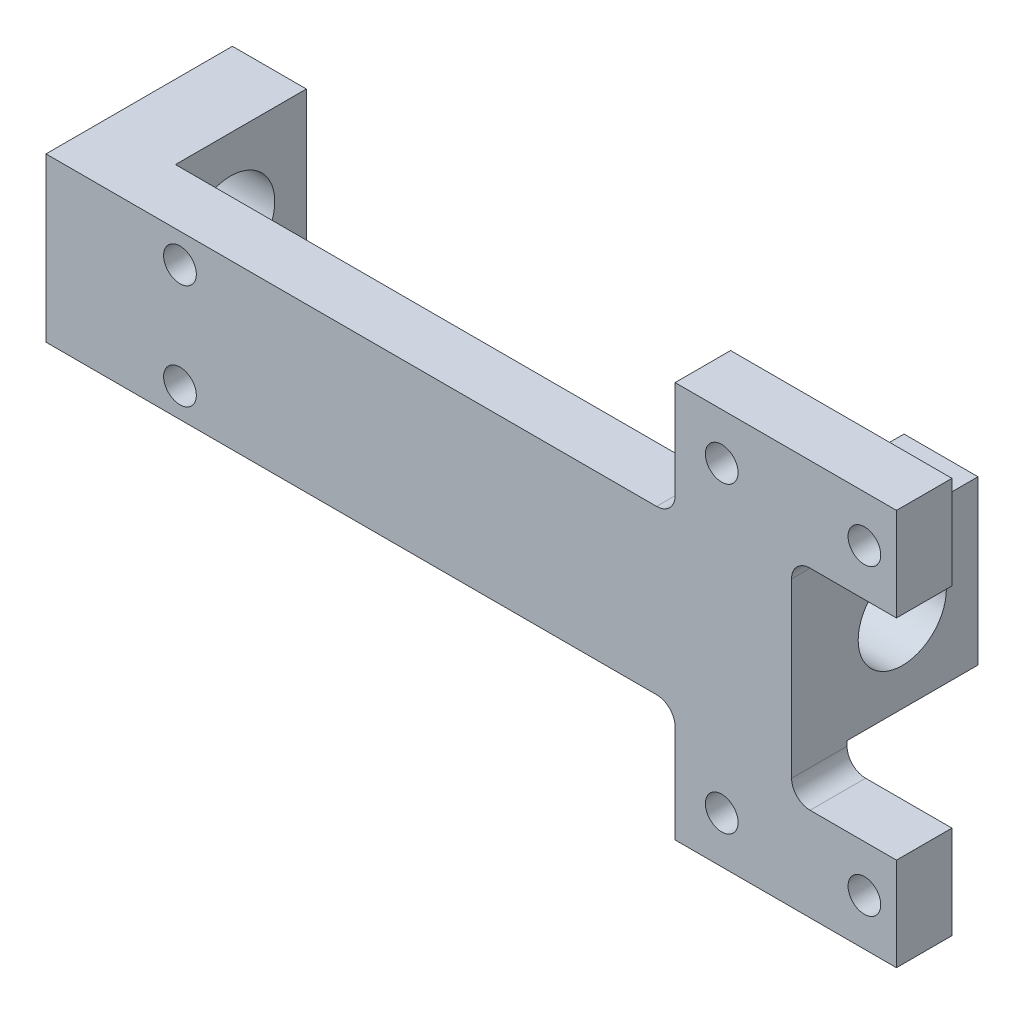
ISO-10303-21;
HEADER;
FILE_DESCRIPTION(('STEP AP214'),'2;1');
FILE_NAME('part.step','',(''),(''),'','','');
FILE_SCHEMA(('AUTOMOTIVE_DESIGN { 1 0 10303 214 1 1 1 1 }'));
ENDSEC;
DATA;
#1=APPLICATION_CONTEXT('core data for automotive mechanical design processes');
#2=APPLICATION_PROTOCOL_DEFINITION('international standard','automotive_design',2000,#1);
#3=PRODUCT_CONTEXT('',#1,'mechanical');
#4=PRODUCT('Part','Part','',(#3));
#5=PRODUCT_RELATED_PRODUCT_CATEGORY('part','',(#4));
#6=PRODUCT_DEFINITION_FORMATION('','',#4);
#7=PRODUCT_DEFINITION_CONTEXT('part definition',#1,'design');
#8=PRODUCT_DEFINITION('design','',#6,#7);
#9=PRODUCT_DEFINITION_SHAPE('','',#8);
#10=(LENGTH_UNIT() NAMED_UNIT(*) SI_UNIT(.MILLI.,.METRE.));
#11=(NAMED_UNIT(*) PLANE_ANGLE_UNIT() SI_UNIT($,.RADIAN.));
#12=(NAMED_UNIT(*) SI_UNIT($,.STERADIAN.) SOLID_ANGLE_UNIT());
#13=UNCERTAINTY_MEASURE_WITH_UNIT(LENGTH_MEASURE(1.E-05),#10,'distance_accuracy_value','');
#14=(GEOMETRIC_REPRESENTATION_CONTEXT(3) GLOBAL_UNCERTAINTY_ASSIGNED_CONTEXT((#13)) GLOBAL_UNIT_ASSIGNED_CONTEXT((#10,
#11,#12)) REPRESENTATION_CONTEXT('',''));
#15=CARTESIAN_POINT('',(0.,0.,0.));
#16=DIRECTION('',(0.,0.,1.));
#17=DIRECTION('',(1.,0.,0.));
#18=AXIS2_PLACEMENT_3D('',#15,#16,#17);
#19=CARTESIAN_POINT('',(64.,14.,-13.));
#20=DIRECTION('',(0.,-1.,0.));
#21=DIRECTION('',(0.,0.,-1.));
#22=AXIS2_PLACEMENT_3D('',#19,#20,#21);
#23=PLANE('',#22);
#24=DIRECTION('',(-1.,0.,0.));
#25=VECTOR('',#24,1.);
#26=CARTESIAN_POINT('',(64.,14.,19.));
#27=LINE('',#26,#25);
#28=CARTESIAN_POINT('',(40.825,14.,19.));
#29=VERTEX_POINT('',#28);
#30=CARTESIAN_POINT('',(-64.,14.,19.));
#31=VERTEX_POINT('',#30);
#32=EDGE_CURVE('E220',#29,#31,#27,.T.);
#33=ORIENTED_EDGE('',*,*,#32,.F.);
#34=DIRECTION('',(0.,0.,-1.));
#35=VECTOR('',#34,1.);
#36=CARTESIAN_POINT('',(40.825,14.,9.47500000000001));
#37=LINE('',#36,#35);
#38=CARTESIAN_POINT('',(40.825,14.,9.475));
#39=VERTEX_POINT('',#38);
#40=EDGE_CURVE('E227',#29,#39,#37,.T.);
#41=ORIENTED_EDGE('',*,*,#40,.T.);
#42=DIRECTION('',(1.,0.,0.));
#43=VECTOR('',#42,1.);
#44=CARTESIAN_POINT('',(-51.3,14.,9.475));
#45=LINE('',#44,#43);
#46=CARTESIAN_POINT('',(-51.3,14.,9.475));
#47=VERTEX_POINT('',#46);
#48=EDGE_CURVE('E252',#47,#39,#45,.T.);
#49=ORIENTED_EDGE('',*,*,#48,.F.);
#50=DIRECTION('',(0.,0.,-1.));
#51=VECTOR('',#50,1.);
#52=CARTESIAN_POINT('',(-51.3,14.,125.352056867745));
#53=LINE('',#52,#51);
#54=CARTESIAN_POINT('',(-51.3,14.,-13.));
#55=VERTEX_POINT('',#54);
#56=EDGE_CURVE('E305',#47,#55,#53,.T.);
#57=ORIENTED_EDGE('',*,*,#56,.T.);
#58=DIRECTION('',(-1.,0.,0.));
#59=VECTOR('',#58,1.);
#60=CARTESIAN_POINT('',(64.,14.,-13.));
#61=LINE('',#60,#59);
#62=CARTESIAN_POINT('',(-64.,14.,-13.));
#63=VERTEX_POINT('',#62);
#64=EDGE_CURVE('E788',#55,#63,#61,.T.);
#65=ORIENTED_EDGE('',*,*,#64,.T.);
#66=DIRECTION('',(0.,0.,1.));
#67=VECTOR('',#66,1.);
#68=CARTESIAN_POINT('',(-64.,14.,-13.));
#69=LINE('',#68,#67);
#70=EDGE_CURVE('E284',#63,#31,#69,.T.);
#71=ORIENTED_EDGE('',*,*,#70,.T.);
#72=EDGE_LOOP('',(#33,#41,#49,#57,#65,#71));
#73=FACE_BOUND('',#72,.T.);
#74=ADVANCED_FACE('F34',(#73),#23,.F.);
#75=CARTESIAN_POINT('',(64.,-14.,19.));
#76=DIRECTION('',(0.,1.,0.));
#77=DIRECTION('',(0.,0.,1.));
#78=AXIS2_PLACEMENT_3D('',#75,#76,#77);
#79=PLANE('',#78);
#80=DIRECTION('',(1.,0.,0.));
#81=VECTOR('',#80,1.);
#82=CARTESIAN_POINT('',(44.,-14.,9.475));
#83=LINE('',#82,#81);
#84=CARTESIAN_POINT('',(51.3,-14.,9.475));
#85=VERTEX_POINT('',#84);
#86=CARTESIAN_POINT('',(64.,-14.,9.475));
#87=VERTEX_POINT('',#86);
#88=EDGE_CURVE('E321',#85,#87,#83,.T.);
#89=ORIENTED_EDGE('',*,*,#88,.F.);
#90=DIRECTION('',(0.,0.,-1.));
#91=VECTOR('',#90,1.);
#92=CARTESIAN_POINT('',(51.3,-14.,125.352056867745));
#93=LINE('',#92,#91);
#94=CARTESIAN_POINT('',(51.3,-14.,-13.));
#95=VERTEX_POINT('',#94);
#96=EDGE_CURVE('E255',#85,#95,#93,.T.);
#97=ORIENTED_EDGE('',*,*,#96,.T.);
#98=DIRECTION('',(-1.,0.,0.));
#99=VECTOR('',#98,1.);
#100=CARTESIAN_POINT('',(64.,-14.,-13.));
#101=LINE('',#100,#99);
#102=CARTESIAN_POINT('',(64.,-14.,-13.));
#103=VERTEX_POINT('',#102);
#104=EDGE_CURVE('E325',#103,#95,#101,.T.);
#105=ORIENTED_EDGE('',*,*,#104,.F.);
#106=DIRECTION('',(0.,0.,-1.));
#107=VECTOR('',#106,1.);
#108=CARTESIAN_POINT('',(64.,-14.,19.));
#109=LINE('',#108,#107);
#110=EDGE_CURVE('E290',#87,#103,#109,.T.);
#111=ORIENTED_EDGE('',*,*,#110,.F.);
#112=EDGE_LOOP('',(#89,#97,#105,#111));
#113=FACE_BOUND('',#112,.T.);
#114=ADVANCED_FACE('F467',(#113),#79,.F.);
#115=DIRECTION('',(-1.,0.,0.));
#116=VECTOR('',#115,1.);
#117=CARTESIAN_POINT('',(-51.3,-14.,9.475));
#118=LINE('',#117,#116);
#119=CARTESIAN_POINT('',(40.825,-14.,9.475));
#120=VERTEX_POINT('',#119);
#121=CARTESIAN_POINT('',(-51.3,-14.,9.475));
#122=VERTEX_POINT('',#121);
#123=EDGE_CURVE('E295',#120,#122,#118,.T.);
#124=ORIENTED_EDGE('',*,*,#123,.F.);
#125=DIRECTION('',(0.,0.,-1.));
#126=VECTOR('',#125,1.);
#127=CARTESIAN_POINT('',(40.825,-14.,19.));
#128=LINE('',#127,#126);
#129=CARTESIAN_POINT('',(40.825,-14.,19.));
#130=VERTEX_POINT('',#129);
#131=EDGE_CURVE('E300',#120,#130,#128,.F.);
#132=ORIENTED_EDGE('',*,*,#131,.T.);
#133=DIRECTION('',(-1.,0.,0.));
#134=VECTOR('',#133,1.);
#135=CARTESIAN_POINT('',(64.,-14.,19.));
#136=LINE('',#135,#134);
#137=CARTESIAN_POINT('',(-64.,-14.,19.));
#138=VERTEX_POINT('',#137);
#139=EDGE_CURVE('E276',#130,#138,#136,.T.);
#140=ORIENTED_EDGE('',*,*,#139,.T.);
#141=DIRECTION('',(0.,0.,-1.));
#142=VECTOR('',#141,1.);
#143=CARTESIAN_POINT('',(-64.,-14.,19.));
#144=LINE('',#143,#142);
#145=CARTESIAN_POINT('',(-64.,-14.,-13.));
#146=VERTEX_POINT('',#145);
#147=EDGE_CURVE('E277',#138,#146,#144,.T.);
#148=ORIENTED_EDGE('',*,*,#147,.T.);
#149=CARTESIAN_POINT('',(-51.3,-14.,-13.));
#150=VERTEX_POINT('',#149);
#151=EDGE_CURVE('E470',#150,#146,#101,.T.);
#152=ORIENTED_EDGE('',*,*,#151,.F.);
#153=DIRECTION('',(0.,0.,-1.));
#154=VECTOR('',#153,1.);
#155=CARTESIAN_POINT('',(-51.3,-14.,125.352056867745));
#156=LINE('',#155,#154);
#157=EDGE_CURVE('E258',#122,#150,#156,.T.);
#158=ORIENTED_EDGE('',*,*,#157,.F.);
#159=EDGE_LOOP('',(#124,#132,#140,#148,#152,#158));
#160=FACE_BOUND('',#159,.T.);
#161=ADVANCED_FACE('F495',(#160),#79,.F.);
#162=CARTESIAN_POINT('',(64.,-14.,-13.));
#163=DIRECTION('',(0.,0.,1.));
#164=DIRECTION('',(1.,0.,0.));
#165=AXIS2_PLACEMENT_3D('',#162,#163,#164);
#166=PLANE('',#165);
#167=DIRECTION('',(0.,1.,0.));
#168=VECTOR('',#167,1.);
#169=CARTESIAN_POINT('',(-51.3,-14.,-13.));
#170=LINE('',#169,#168);
#171=EDGE_CURVE('E310',#150,#55,#170,.T.);
#172=ORIENTED_EDGE('',*,*,#171,.F.);
#173=ORIENTED_EDGE('',*,*,#151,.T.);
#174=DIRECTION('',(0.,1.,0.));
#175=VECTOR('',#174,1.);
#176=CARTESIAN_POINT('',(-64.,-14.,-13.));
#177=LINE('',#176,#175);
#178=EDGE_CURVE('E280',#146,#63,#177,.T.);
#179=ORIENTED_EDGE('',*,*,#178,.T.);
#180=ORIENTED_EDGE('',*,*,#64,.F.);
#181=EDGE_LOOP('',(#172,#173,#179,#180));
#182=FACE_BOUND('',#181,.T.);
#183=ADVANCED_FACE('F507',(#182),#166,.F.);
#184=DIRECTION('',(0.,-1.,0.));
#185=VECTOR('',#184,1.);
#186=CARTESIAN_POINT('',(51.3,-14.,-13.));
#187=LINE('',#186,#185);
#188=CARTESIAN_POINT('',(51.3,14.,-13.));
#189=VERTEX_POINT('',#188);
#190=EDGE_CURVE('E307',#189,#95,#187,.T.);
#191=ORIENTED_EDGE('',*,*,#190,.F.);
#192=CARTESIAN_POINT('',(64.,14.,-13.));
#193=VERTEX_POINT('',#192);
#194=EDGE_CURVE('E461',#193,#189,#61,.T.);
#195=ORIENTED_EDGE('',*,*,#194,.F.);
#196=DIRECTION('',(0.,1.,0.));
#197=VECTOR('',#196,1.);
#198=CARTESIAN_POINT('',(64.,-14.,-13.));
#199=LINE('',#198,#197);
#200=EDGE_CURVE('E267',#103,#193,#199,.T.);
#201=ORIENTED_EDGE('',*,*,#200,.F.);
#202=ORIENTED_EDGE('',*,*,#104,.T.);
#203=EDGE_LOOP('',(#191,#195,#201,#202));
#204=FACE_BOUND('',#203,.T.);
#205=ADVANCED_FACE('F469',(#204),#166,.F.);
#206=DIRECTION('',(0.,0.,-1.));
#207=VECTOR('',#206,1.);
#208=CARTESIAN_POINT('',(51.3,14.,125.352056867745));
#209=LINE('',#208,#207);
#210=CARTESIAN_POINT('',(51.3,14.,9.475));
#211=VERTEX_POINT('',#210);
#212=EDGE_CURVE('E299',#211,#189,#209,.T.);
#213=ORIENTED_EDGE('',*,*,#212,.F.);
#214=DIRECTION('',(1.,0.,0.));
#215=VECTOR('',#214,1.);
#216=CARTESIAN_POINT('',(44.,14.,9.475));
#217=LINE('',#216,#215);
#218=CARTESIAN_POINT('',(64.,14.,9.475));
#219=VERTEX_POINT('',#218);
#220=EDGE_CURVE('E324',#211,#219,#217,.T.);
#221=ORIENTED_EDGE('',*,*,#220,.T.);
#222=DIRECTION('',(0.,0.,1.));
#223=VECTOR('',#222,1.);
#224=CARTESIAN_POINT('',(64.,14.,-13.));
#225=LINE('',#224,#223);
#226=EDGE_CURVE('E262',#193,#219,#225,.T.);
#227=ORIENTED_EDGE('',*,*,#226,.F.);
#228=ORIENTED_EDGE('',*,*,#194,.T.);
#229=EDGE_LOOP('',(#213,#221,#227,#228));
#230=FACE_BOUND('',#229,.T.);
#231=ADVANCED_FACE('F460',(#230),#23,.F.);
#232=CARTESIAN_POINT('',(64.,0.,0.));
#233=DIRECTION('',(-1.,0.,0.));
#234=DIRECTION('',(0.,0.,1.));
#235=AXIS2_PLACEMENT_3D('',#232,#233,#234);
#236=CYLINDRICAL_SURFACE('',#235,7.5692);
#237=CARTESIAN_POINT('',(-64.,0.,0.));
#238=DIRECTION('',(1.,0.,0.));
#239=DIRECTION('',(0.,0.,-1.));
#240=AXIS2_PLACEMENT_3D('',#237,#238,#239);
#241=CIRCLE('',#240,7.5692);
#242=CARTESIAN_POINT('',(-64.,0.,-7.5692));
#243=VERTEX_POINT('',#242);
#244=EDGE_CURVE('E312',#243,#243,#241,.T.);
#245=ORIENTED_EDGE('',*,*,#244,.F.);
#246=EDGE_LOOP('',(#245));
#247=FACE_BOUND('',#246,.T.);
#248=CARTESIAN_POINT('',(-51.3,0.,0.));
#249=DIRECTION('',(1.,0.,0.));
#250=DIRECTION('',(0.,0.,-1.));
#251=AXIS2_PLACEMENT_3D('',#248,#249,#250);
#252=CIRCLE('',#251,7.5692);
#253=CARTESIAN_POINT('',(-51.3,0.,-7.5692));
#254=VERTEX_POINT('',#253);
#255=EDGE_CURVE('E309',#254,#254,#252,.T.);
#256=ORIENTED_EDGE('',*,*,#255,.T.);
#257=EDGE_LOOP('',(#256));
#258=FACE_BOUND('',#257,.T.);
#259=ADVANCED_FACE('F501',(#247,#258),#236,.F.);
#260=CARTESIAN_POINT('',(64.,0.,0.));
#261=DIRECTION('',(1.,0.,0.));
#262=DIRECTION('',(0.,0.,-1.));
#263=AXIS2_PLACEMENT_3D('',#260,#261,#262);
#264=CIRCLE('',#263,7.5692);
#265=CARTESIAN_POINT('',(64.,0.,-7.5692));
#266=VERTEX_POINT('',#265);
#267=EDGE_CURVE('E281',#266,#266,#264,.T.);
#268=ORIENTED_EDGE('',*,*,#267,.T.);
#269=EDGE_LOOP('',(#268));
#270=FACE_BOUND('',#269,.T.);
#271=CARTESIAN_POINT('',(51.3,0.,0.));
#272=DIRECTION('',(-1.,0.,0.));
#273=DIRECTION('',(0.,0.,1.));
#274=AXIS2_PLACEMENT_3D('',#271,#272,#273);
#275=CIRCLE('',#274,7.5692);
#276=CARTESIAN_POINT('',(51.3,0.,7.5692));
#277=VERTEX_POINT('',#276);
#278=EDGE_CURVE('E251',#277,#277,#275,.T.);
#279=ORIENTED_EDGE('',*,*,#278,.T.);
#280=EDGE_LOOP('',(#279));
#281=FACE_BOUND('',#280,.T.);
#282=ADVANCED_FACE('F475',(#270,#281),#236,.F.);
#283=CARTESIAN_POINT('',(64.,0.,0.));
#284=DIRECTION('',(1.,0.,0.));
#285=DIRECTION('',(0.,0.,-1.));
#286=AXIS2_PLACEMENT_3D('',#283,#284,#285);
#287=PLANE('',#286);
#288=DIRECTION('',(0.,1.,0.));
#289=VECTOR('',#288,1.);
#290=CARTESIAN_POINT('',(64.,14.,9.475));
#291=LINE('',#290,#289);
#292=CARTESIAN_POINT('',(64.,14.825,9.475));
#293=VERTEX_POINT('',#292);
#294=EDGE_CURVE('E194',#219,#293,#291,.T.);
#295=ORIENTED_EDGE('',*,*,#294,.T.);
#296=DIRECTION('',(0.,0.,-1.));
#297=VECTOR('',#296,1.);
#298=CARTESIAN_POINT('',(64.,14.825,0.));
#299=LINE('',#298,#297);
#300=CARTESIAN_POINT('',(64.,14.825,19.));
#301=VERTEX_POINT('',#300);
#302=EDGE_CURVE('E424',#293,#301,#299,.F.);
#303=ORIENTED_EDGE('',*,*,#302,.T.);
#304=DIRECTION('',(0.,-1.,0.));
#305=VECTOR('',#304,1.);
#306=CARTESIAN_POINT('',(64.,14.,19.));
#307=LINE('',#306,#305);
#308=CARTESIAN_POINT('',(64.,-14.825,19.));
#309=VERTEX_POINT('',#308);
#310=EDGE_CURVE('E266',#301,#309,#307,.T.);
#311=ORIENTED_EDGE('',*,*,#310,.T.);
#312=DIRECTION('',(0.,0.,-1.));
#313=VECTOR('',#312,1.);
#314=CARTESIAN_POINT('',(64.,-14.825,9.475));
#315=LINE('',#314,#313);
#316=CARTESIAN_POINT('',(64.,-14.825,9.475));
#317=VERTEX_POINT('',#316);
#318=EDGE_CURVE('E421',#309,#317,#315,.T.);
#319=ORIENTED_EDGE('',*,*,#318,.T.);
#320=DIRECTION('',(0.,-1.,0.));
#321=VECTOR('',#320,1.);
#322=CARTESIAN_POINT('',(64.,-14.,9.475));
#323=LINE('',#322,#321);
#324=EDGE_CURVE('E242',#87,#317,#323,.T.);
#325=ORIENTED_EDGE('',*,*,#324,.F.);
#326=ORIENTED_EDGE('',*,*,#110,.T.);
#327=ORIENTED_EDGE('',*,*,#200,.T.);
#328=ORIENTED_EDGE('',*,*,#226,.T.);
#329=EDGE_LOOP('',(#295,#303,#311,#319,#325,#326,#327,#328));
#330=FACE_BOUND('',#329,.T.);
#331=ORIENTED_EDGE('',*,*,#267,.F.);
#332=EDGE_LOOP('',(#331));
#333=FACE_BOUND('',#332,.T.);
#334=ADVANCED_FACE('F453',(#330,#333),#287,.T.);
#335=CARTESIAN_POINT('',(-64.,0.,0.));
#336=DIRECTION('',(1.,0.,0.));
#337=DIRECTION('',(0.,0.,-1.));
#338=AXIS2_PLACEMENT_3D('',#335,#336,#337);
#339=PLANE('',#338);
#340=ORIENTED_EDGE('',*,*,#147,.F.);
#341=DIRECTION('',(0.,-1.,0.));
#342=VECTOR('',#341,1.);
#343=CARTESIAN_POINT('',(-64.,14.,19.));
#344=LINE('',#343,#342);
#345=EDGE_CURVE('E287',#31,#138,#344,.T.);
#346=ORIENTED_EDGE('',*,*,#345,.F.);
#347=ORIENTED_EDGE('',*,*,#70,.F.);
#348=ORIENTED_EDGE('',*,*,#178,.F.);
#349=EDGE_LOOP('',(#340,#346,#347,#348));
#350=FACE_BOUND('',#349,.T.);
#351=ORIENTED_EDGE('',*,*,#244,.T.);
#352=EDGE_LOOP('',(#351));
#353=FACE_BOUND('',#352,.T.);
#354=ADVANCED_FACE('F612',(#350,#353),#339,.F.);
#355=CARTESIAN_POINT('',(64.,14.,19.));
#356=DIRECTION('',(0.,0.,-1.));
#357=DIRECTION('',(-1.,0.,0.));
#358=AXIS2_PLACEMENT_3D('',#355,#356,#357);
#359=PLANE('',#358);
#360=CARTESIAN_POINT('',(76.5,26.,19.));
#361=DIRECTION('',(0.,0.,-1.));
#362=DIRECTION('',(-1.,0.,0.));
#363=AXIS2_PLACEMENT_3D('',#360,#361,#362);
#364=CIRCLE('',#363,2.8067);
#365=CARTESIAN_POINT('',(73.6933,26.,19.));
#366=VERTEX_POINT('',#365);
#367=EDGE_CURVE('E801',#366,#366,#364,.T.);
#368=ORIENTED_EDGE('',*,*,#367,.T.);
#369=EDGE_LOOP('',(#368));
#370=FACE_BOUND('',#369,.T.);
#371=CARTESIAN_POINT('',(52.,26.,19.));
#372=DIRECTION('',(0.,0.,-1.));
#373=DIRECTION('',(-1.,0.,0.));
#374=AXIS2_PLACEMENT_3D('',#371,#372,#373);
#375=CIRCLE('',#374,2.8067);
#376=CARTESIAN_POINT('',(49.1933,26.,19.));
#377=VERTEX_POINT('',#376);
#378=EDGE_CURVE('E207',#377,#377,#375,.T.);
#379=ORIENTED_EDGE('',*,*,#378,.T.);
#380=EDGE_LOOP('',(#379));
#381=FACE_BOUND('',#380,.T.);
#382=CARTESIAN_POINT('',(76.5,-26.,19.));
#383=DIRECTION('',(0.,0.,-1.));
#384=DIRECTION('',(-1.,0.,0.));
#385=AXIS2_PLACEMENT_3D('',#382,#383,#384);
#386=CIRCLE('',#385,2.8067);
#387=CARTESIAN_POINT('',(73.6933,-26.,19.));
#388=VERTEX_POINT('',#387);
#389=EDGE_CURVE('E389',#388,#388,#386,.T.);
#390=ORIENTED_EDGE('',*,*,#389,.T.);
#391=EDGE_LOOP('',(#390));
#392=FACE_BOUND('',#391,.T.);
#393=CARTESIAN_POINT('',(52.,-26.,19.));
#394=DIRECTION('',(0.,0.,-1.));
#395=DIRECTION('',(-1.,0.,0.));
#396=AXIS2_PLACEMENT_3D('',#393,#394,#395);
#397=CIRCLE('',#396,2.8067);
#398=CARTESIAN_POINT('',(49.1933,-26.,19.));
#399=VERTEX_POINT('',#398);
#400=EDGE_CURVE('E395',#399,#399,#397,.T.);
#401=ORIENTED_EDGE('',*,*,#400,.T.);
#402=EDGE_LOOP('',(#401));
#403=FACE_BOUND('',#402,.T.);
#404=CARTESIAN_POINT('',(-41.,-8.99999999999999,19.));
#405=DIRECTION('',(0.,0.,-1.));
#406=DIRECTION('',(-1.,0.,0.));
#407=AXIS2_PLACEMENT_3D('',#404,#405,#406);
#408=CIRCLE('',#407,2.8067);
#409=CARTESIAN_POINT('',(-43.8067,-8.99999999999999,19.));
#410=VERTEX_POINT('',#409);
#411=EDGE_CURVE('E347',#410,#410,#408,.T.);
#412=ORIENTED_EDGE('',*,*,#411,.T.);
#413=EDGE_LOOP('',(#412));
#414=FACE_BOUND('',#413,.T.);
#415=CARTESIAN_POINT('',(-41.,9.00000000000001,19.));
#416=DIRECTION('',(0.,0.,-1.));
#417=DIRECTION('',(-1.,0.,0.));
#418=AXIS2_PLACEMENT_3D('',#415,#416,#417);
#419=CIRCLE('',#418,2.8067);
#420=CARTESIAN_POINT('',(-43.8067,9.00000000000001,19.));
#421=VERTEX_POINT('',#420);
#422=EDGE_CURVE('E259',#421,#421,#419,.T.);
#423=ORIENTED_EDGE('',*,*,#422,.T.);
#424=EDGE_LOOP('',(#423));
#425=FACE_BOUND('',#424,.T.);
#426=ORIENTED_EDGE('',*,*,#345,.T.);
#427=ORIENTED_EDGE('',*,*,#139,.F.);
#428=CARTESIAN_POINT('',(40.825,-17.175,19.));
#429=DIRECTION('',(0.,0.,-1.));
#430=DIRECTION('',(-1.,0.,0.));
#431=AXIS2_PLACEMENT_3D('',#428,#429,#430);
#432=CIRCLE('',#431,3.175);
#433=CARTESIAN_POINT('',(44.,-17.175,19.));
#434=VERTEX_POINT('',#433);
#435=EDGE_CURVE('E436',#130,#434,#432,.T.);
#436=ORIENTED_EDGE('',*,*,#435,.T.);
#437=DIRECTION('',(0.,-1.,0.));
#438=VECTOR('',#437,1.);
#439=CARTESIAN_POINT('',(44.,-14.,19.));
#440=LINE('',#439,#438);
#441=CARTESIAN_POINT('',(44.,-34.,19.));
#442=VERTEX_POINT('',#441);
#443=EDGE_CURVE('E231',#434,#442,#440,.T.);
#444=ORIENTED_EDGE('',*,*,#443,.T.);
#445=DIRECTION('',(1.,0.,0.));
#446=VECTOR('',#445,1.);
#447=CARTESIAN_POINT('',(44.,-34.,19.));
#448=LINE('',#447,#446);
#449=CARTESIAN_POINT('',(82.,-34.,19.));
#450=VERTEX_POINT('',#449);
#451=EDGE_CURVE('E235',#442,#450,#448,.T.);
#452=ORIENTED_EDGE('',*,*,#451,.T.);
#453=DIRECTION('',(0.,1.,0.));
#454=VECTOR('',#453,1.);
#455=CARTESIAN_POINT('',(82.,-18.,19.));
#456=LINE('',#455,#454);
#457=CARTESIAN_POINT('',(82.,-18.,19.));
#458=VERTEX_POINT('',#457);
#459=EDGE_CURVE('E398',#450,#458,#456,.T.);
#460=ORIENTED_EDGE('',*,*,#459,.T.);
#461=DIRECTION('',(-1.,0.,0.));
#462=VECTOR('',#461,1.);
#463=CARTESIAN_POINT('',(64.,-18.,19.));
#464=LINE('',#463,#462);
#465=CARTESIAN_POINT('',(67.175,-18.,19.));
#466=VERTEX_POINT('',#465);
#467=EDGE_CURVE('E340',#458,#466,#464,.T.);
#468=ORIENTED_EDGE('',*,*,#467,.T.);
#469=CARTESIAN_POINT('',(67.175,-14.825,19.));
#470=DIRECTION('',(0.,0.,-1.));
#471=DIRECTION('',(-1.,0.,0.));
#472=AXIS2_PLACEMENT_3D('',#469,#470,#471);
#473=CIRCLE('',#472,3.175);
#474=EDGE_CURVE('E12',#466,#309,#473,.T.);
#475=ORIENTED_EDGE('',*,*,#474,.T.);
#476=ORIENTED_EDGE('',*,*,#310,.F.);
#477=CARTESIAN_POINT('',(67.175,14.825,19.));
#478=DIRECTION('',(0.,0.,-1.));
#479=DIRECTION('',(-1.,0.,0.));
#480=AXIS2_PLACEMENT_3D('',#477,#478,#479);
#481=CIRCLE('',#480,3.175);
#482=CARTESIAN_POINT('',(67.175,18.,19.));
#483=VERTEX_POINT('',#482);
#484=EDGE_CURVE('E440',#301,#483,#481,.T.);
#485=ORIENTED_EDGE('',*,*,#484,.T.);
#486=DIRECTION('',(-1.,0.,0.));
#487=VECTOR('',#486,1.);
#488=CARTESIAN_POINT('',(64.,18.,19.));
#489=LINE('',#488,#487);
#490=CARTESIAN_POINT('',(82.,18.,19.));
#491=VERTEX_POINT('',#490);
#492=EDGE_CURVE('E226',#491,#483,#489,.T.);
#493=ORIENTED_EDGE('',*,*,#492,.F.);
#494=DIRECTION('',(0.,-1.,0.));
#495=VECTOR('',#494,1.);
#496=CARTESIAN_POINT('',(82.,18.,19.));
#497=LINE('',#496,#495);
#498=CARTESIAN_POINT('',(82.,34.,19.));
#499=VERTEX_POINT('',#498);
#500=EDGE_CURVE('E386',#499,#491,#497,.T.);
#501=ORIENTED_EDGE('',*,*,#500,.F.);
#502=DIRECTION('',(1.,0.,0.));
#503=VECTOR('',#502,1.);
#504=CARTESIAN_POINT('',(44.,34.,19.));
#505=LINE('',#504,#503);
#506=CARTESIAN_POINT('',(44.,34.,19.));
#507=VERTEX_POINT('',#506);
#508=EDGE_CURVE('E383',#507,#499,#505,.T.);
#509=ORIENTED_EDGE('',*,*,#508,.F.);
#510=DIRECTION('',(0.,1.,0.));
#511=VECTOR('',#510,1.);
#512=CARTESIAN_POINT('',(44.,14.,19.));
#513=LINE('',#512,#511);
#514=CARTESIAN_POINT('',(44.,17.175,19.));
#515=VERTEX_POINT('',#514);
#516=EDGE_CURVE('E189',#515,#507,#513,.T.);
#517=ORIENTED_EDGE('',*,*,#516,.F.);
#518=CARTESIAN_POINT('',(40.825,17.175,19.));
#519=DIRECTION('',(0.,0.,-1.));
#520=DIRECTION('',(-1.,0.,0.));
#521=AXIS2_PLACEMENT_3D('',#518,#519,#520);
#522=CIRCLE('',#521,3.175);
#523=EDGE_CURVE('E432',#515,#29,#522,.T.);
#524=ORIENTED_EDGE('',*,*,#523,.T.);
#525=ORIENTED_EDGE('',*,*,#32,.T.);
#526=EDGE_LOOP('',(#426,#427,#436,#444,#452,#460,#468,#475,#476,#485,#493,#501,#509,#517,#524,#525));
#527=FACE_BOUND('',#526,.T.);
#528=ADVANCED_FACE('F402',(#370,#381,#392,#403,#414,#425,#527),#359,.F.);
#529=CARTESIAN_POINT('',(-51.3,-14.,125.352056867745));
#530=DIRECTION('',(1.,0.,0.));
#531=DIRECTION('',(0.,0.,-1.));
#532=AXIS2_PLACEMENT_3D('',#529,#530,#531);
#533=PLANE('',#532);
#534=ORIENTED_EDGE('',*,*,#255,.F.);
#535=EDGE_LOOP('',(#534));
#536=FACE_BOUND('',#535,.T.);
#537=ORIENTED_EDGE('',*,*,#171,.T.);
#538=ORIENTED_EDGE('',*,*,#56,.F.);
#539=DIRECTION('',(0.,1.,0.));
#540=VECTOR('',#539,1.);
#541=CARTESIAN_POINT('',(-51.3,-14.,9.475));
#542=LINE('',#541,#540);
#543=EDGE_CURVE('E298',#122,#47,#542,.T.);
#544=ORIENTED_EDGE('',*,*,#543,.F.);
#545=ORIENTED_EDGE('',*,*,#157,.T.);
#546=EDGE_LOOP('',(#537,#538,#544,#545));
#547=FACE_BOUND('',#546,.T.);
#548=ADVANCED_FACE('F478',(#536,#547),#533,.T.);
#549=CARTESIAN_POINT('',(51.3,-14.,125.352056867745));
#550=DIRECTION('',(-1.,0.,0.));
#551=DIRECTION('',(0.,0.,1.));
#552=AXIS2_PLACEMENT_3D('',#549,#550,#551);
#553=PLANE('',#552);
#554=ORIENTED_EDGE('',*,*,#278,.F.);
#555=EDGE_LOOP('',(#554));
#556=FACE_BOUND('',#555,.T.);
#557=ORIENTED_EDGE('',*,*,#190,.T.);
#558=ORIENTED_EDGE('',*,*,#96,.F.);
#559=DIRECTION('',(0.,-1.,0.));
#560=VECTOR('',#559,1.);
#561=CARTESIAN_POINT('',(51.3,-14.,9.475));
#562=LINE('',#561,#560);
#563=EDGE_CURVE('E248',#211,#85,#562,.T.);
#564=ORIENTED_EDGE('',*,*,#563,.F.);
#565=ORIENTED_EDGE('',*,*,#212,.T.);
#566=EDGE_LOOP('',(#557,#558,#564,#565));
#567=FACE_BOUND('',#566,.T.);
#568=ADVANCED_FACE('F463',(#556,#567),#553,.T.);
#569=CARTESIAN_POINT('',(64.,14.,9.475));
#570=DIRECTION('',(0.,0.,-1.));
#571=DIRECTION('',(-1.,0.,0.));
#572=AXIS2_PLACEMENT_3D('',#569,#570,#571);
#573=PLANE('',#572);
#574=CARTESIAN_POINT('',(76.5,26.,9.475));
#575=DIRECTION('',(0.,0.,-1.));
#576=DIRECTION('',(-1.,0.,0.));
#577=AXIS2_PLACEMENT_3D('',#574,#575,#576);
#578=CIRCLE('',#577,2.8067);
#579=CARTESIAN_POINT('',(73.6933,26.,9.475));
#580=VERTEX_POINT('',#579);
#581=EDGE_CURVE('E804',#580,#580,#578,.T.);
#582=ORIENTED_EDGE('',*,*,#581,.F.);
#583=EDGE_LOOP('',(#582));
#584=FACE_BOUND('',#583,.T.);
#585=CARTESIAN_POINT('',(52.,26.,9.475));
#586=DIRECTION('',(0.,0.,-1.));
#587=DIRECTION('',(-1.,0.,0.));
#588=AXIS2_PLACEMENT_3D('',#585,#586,#587);
#589=CIRCLE('',#588,2.8067);
#590=CARTESIAN_POINT('',(49.1933,26.,9.475));
#591=VERTEX_POINT('',#590);
#592=EDGE_CURVE('E210',#591,#591,#589,.T.);
#593=ORIENTED_EDGE('',*,*,#592,.F.);
#594=EDGE_LOOP('',(#593));
#595=FACE_BOUND('',#594,.T.);
#596=CARTESIAN_POINT('',(76.5,-26.,9.475));
#597=DIRECTION('',(0.,0.,-1.));
#598=DIRECTION('',(-1.,0.,0.));
#599=AXIS2_PLACEMENT_3D('',#596,#597,#598);
#600=CIRCLE('',#599,2.8067);
#601=CARTESIAN_POINT('',(73.6933,-26.,9.475));
#602=VERTEX_POINT('',#601);
#603=EDGE_CURVE('E225',#602,#602,#600,.T.);
#604=ORIENTED_EDGE('',*,*,#603,.F.);
#605=EDGE_LOOP('',(#604));
#606=FACE_BOUND('',#605,.T.);
#607=CARTESIAN_POINT('',(52.,-26.,9.475));
#608=DIRECTION('',(0.,0.,-1.));
#609=DIRECTION('',(-1.,0.,0.));
#610=AXIS2_PLACEMENT_3D('',#607,#608,#609);
#611=CIRCLE('',#610,2.8067);
#612=CARTESIAN_POINT('',(49.1933,-26.,9.475));
#613=VERTEX_POINT('',#612);
#614=EDGE_CURVE('E392',#613,#613,#611,.T.);
#615=ORIENTED_EDGE('',*,*,#614,.F.);
#616=EDGE_LOOP('',(#615));
#617=FACE_BOUND('',#616,.T.);
#618=CARTESIAN_POINT('',(-41.,-8.99999999999999,9.475));
#619=DIRECTION('',(0.,0.,-1.));
#620=DIRECTION('',(-1.,0.,0.));
#621=AXIS2_PLACEMENT_3D('',#618,#619,#620);
#622=CIRCLE('',#621,2.8067);
#623=CARTESIAN_POINT('',(-43.8067,-8.99999999999999,9.475));
#624=VERTEX_POINT('',#623);
#625=EDGE_CURVE('E234',#624,#624,#622,.T.);
#626=ORIENTED_EDGE('',*,*,#625,.F.);
#627=EDGE_LOOP('',(#626));
#628=FACE_BOUND('',#627,.T.);
#629=CARTESIAN_POINT('',(-41.,9.00000000000001,9.475));
#630=DIRECTION('',(0.,0.,-1.));
#631=DIRECTION('',(-1.,0.,0.));
#632=AXIS2_PLACEMENT_3D('',#629,#630,#631);
#633=CIRCLE('',#632,2.8067);
#634=CARTESIAN_POINT('',(-43.8067,9.00000000000001,9.475));
#635=VERTEX_POINT('',#634);
#636=EDGE_CURVE('E350',#635,#635,#633,.T.);
#637=ORIENTED_EDGE('',*,*,#636,.F.);
#638=EDGE_LOOP('',(#637));
#639=FACE_BOUND('',#638,.T.);
#640=ORIENTED_EDGE('',*,*,#48,.T.);
#641=CARTESIAN_POINT('',(40.825,17.175,9.475));
#642=DIRECTION('',(0.,0.,-1.));
#643=DIRECTION('',(-1.,0.,0.));
#644=AXIS2_PLACEMENT_3D('',#641,#642,#643);
#645=CIRCLE('',#644,3.175);
#646=CARTESIAN_POINT('',(44.,17.175,9.475));
#647=VERTEX_POINT('',#646);
#648=EDGE_CURVE('E206',#39,#647,#645,.F.);
#649=ORIENTED_EDGE('',*,*,#648,.T.);
#650=DIRECTION('',(0.,-1.,0.));
#651=VECTOR('',#650,1.);
#652=CARTESIAN_POINT('',(44.,14.,9.475));
#653=LINE('',#652,#651);
#654=CARTESIAN_POINT('',(44.,34.,9.475));
#655=VERTEX_POINT('',#654);
#656=EDGE_CURVE('E186',#655,#647,#653,.T.);
#657=ORIENTED_EDGE('',*,*,#656,.F.);
#658=DIRECTION('',(-1.,0.,0.));
#659=VECTOR('',#658,1.);
#660=CARTESIAN_POINT('',(44.,34.,9.475));
#661=LINE('',#660,#659);
#662=CARTESIAN_POINT('',(82.,34.,9.475));
#663=VERTEX_POINT('',#662);
#664=EDGE_CURVE('E197',#663,#655,#661,.T.);
#665=ORIENTED_EDGE('',*,*,#664,.F.);
#666=DIRECTION('',(0.,1.,0.));
#667=VECTOR('',#666,1.);
#668=CARTESIAN_POINT('',(82.,18.,9.475));
#669=LINE('',#668,#667);
#670=CARTESIAN_POINT('',(82.,18.,9.475));
#671=VERTEX_POINT('',#670);
#672=EDGE_CURVE('E202',#671,#663,#669,.T.);
#673=ORIENTED_EDGE('',*,*,#672,.F.);
#674=DIRECTION('',(1.,0.,0.));
#675=VECTOR('',#674,1.);
#676=CARTESIAN_POINT('',(64.,18.,9.475));
#677=LINE('',#676,#675);
#678=CARTESIAN_POINT('',(67.175,18.,9.475));
#679=VERTEX_POINT('',#678);
#680=EDGE_CURVE('E373',#679,#671,#677,.T.);
#681=ORIENTED_EDGE('',*,*,#680,.F.);
#682=CARTESIAN_POINT('',(67.175,14.825,9.475));
#683=DIRECTION('',(0.,0.,-1.));
#684=DIRECTION('',(-1.,0.,0.));
#685=AXIS2_PLACEMENT_3D('',#682,#683,#684);
#686=CIRCLE('',#685,3.175);
#687=EDGE_CURVE('E438',#679,#293,#686,.F.);
#688=ORIENTED_EDGE('',*,*,#687,.T.);
#689=ORIENTED_EDGE('',*,*,#294,.F.);
#690=ORIENTED_EDGE('',*,*,#220,.F.);
#691=ORIENTED_EDGE('',*,*,#563,.T.);
#692=ORIENTED_EDGE('',*,*,#88,.T.);
#693=ORIENTED_EDGE('',*,*,#324,.T.);
#694=CARTESIAN_POINT('',(67.175,-14.825,9.475));
#695=DIRECTION('',(0.,0.,-1.));
#696=DIRECTION('',(-1.,0.,0.));
#697=AXIS2_PLACEMENT_3D('',#694,#695,#696);
#698=CIRCLE('',#697,3.175);
#699=CARTESIAN_POINT('',(67.175,-18.,9.475));
#700=VERTEX_POINT('',#699);
#701=EDGE_CURVE('E42',#317,#700,#698,.F.);
#702=ORIENTED_EDGE('',*,*,#701,.T.);
#703=DIRECTION('',(1.,0.,0.));
#704=VECTOR('',#703,1.);
#705=CARTESIAN_POINT('',(64.,-18.,9.475));
#706=LINE('',#705,#704);
#707=CARTESIAN_POINT('',(82.,-18.,9.475));
#708=VERTEX_POINT('',#707);
#709=EDGE_CURVE('E244',#700,#708,#706,.T.);
#710=ORIENTED_EDGE('',*,*,#709,.T.);
#711=DIRECTION('',(0.,-1.,0.));
#712=VECTOR('',#711,1.);
#713=CARTESIAN_POINT('',(82.,-18.,9.475));
#714=LINE('',#713,#712);
#715=CARTESIAN_POINT('',(82.,-34.,9.475));
#716=VERTEX_POINT('',#715);
#717=EDGE_CURVE('E331',#708,#716,#714,.T.);
#718=ORIENTED_EDGE('',*,*,#717,.T.);
#719=DIRECTION('',(-1.,0.,0.));
#720=VECTOR('',#719,1.);
#721=CARTESIAN_POINT('',(44.,-34.,9.475));
#722=LINE('',#721,#720);
#723=CARTESIAN_POINT('',(44.,-34.,9.475));
#724=VERTEX_POINT('',#723);
#725=EDGE_CURVE('E334',#716,#724,#722,.T.);
#726=ORIENTED_EDGE('',*,*,#725,.T.);
#727=DIRECTION('',(0.,1.,0.));
#728=VECTOR('',#727,1.);
#729=CARTESIAN_POINT('',(44.,-14.,9.475));
#730=LINE('',#729,#728);
#731=CARTESIAN_POINT('',(44.,-17.175,9.475));
#732=VERTEX_POINT('',#731);
#733=EDGE_CURVE('E245',#724,#732,#730,.T.);
#734=ORIENTED_EDGE('',*,*,#733,.T.);
#735=CARTESIAN_POINT('',(40.825,-17.175,9.475));
#736=DIRECTION('',(0.,0.,-1.));
#737=DIRECTION('',(-1.,0.,0.));
#738=AXIS2_PLACEMENT_3D('',#735,#736,#737);
#739=CIRCLE('',#738,3.175);
#740=EDGE_CURVE('E434',#732,#120,#739,.F.);
#741=ORIENTED_EDGE('',*,*,#740,.T.);
#742=ORIENTED_EDGE('',*,*,#123,.T.);
#743=ORIENTED_EDGE('',*,*,#543,.T.);
#744=EDGE_LOOP('',(#640,#649,#657,#665,#673,#681,#688,#689,#690,#691,#692,#693,#702,#710,#718,
#726,#734,#741,#742,#743));
#745=FACE_BOUND('',#744,.T.);
#746=ADVANCED_FACE('F205',(#584,#595,#606,#617,#628,#639,#745),#573,.T.);
#747=CARTESIAN_POINT('',(-41.,9.00000000000001,9.475));
#748=DIRECTION('',(0.,0.,-1.));
#749=DIRECTION('',(-1.,0.,0.));
#750=AXIS2_PLACEMENT_3D('',#747,#748,#749);
#751=CYLINDRICAL_SURFACE('',#750,2.8067);
#752=ORIENTED_EDGE('',*,*,#636,.T.);
#753=EDGE_LOOP('',(#752));
#754=FACE_BOUND('',#753,.T.);
#755=ORIENTED_EDGE('',*,*,#422,.F.);
#756=EDGE_LOOP('',(#755));
#757=FACE_BOUND('',#756,.T.);
#758=ADVANCED_FACE('F484',(#754,#757),#751,.F.);
#759=CARTESIAN_POINT('',(-41.,-8.99999999999999,9.475));
#760=DIRECTION('',(0.,0.,-1.));
#761=DIRECTION('',(-1.,0.,0.));
#762=AXIS2_PLACEMENT_3D('',#759,#760,#761);
#763=CYLINDRICAL_SURFACE('',#762,2.8067);
#764=ORIENTED_EDGE('',*,*,#625,.T.);
#765=EDGE_LOOP('',(#764));
#766=FACE_BOUND('',#765,.T.);
#767=ORIENTED_EDGE('',*,*,#411,.F.);
#768=EDGE_LOOP('',(#767));
#769=FACE_BOUND('',#768,.T.);
#770=ADVANCED_FACE('F590',(#766,#769),#763,.F.);
#771=CARTESIAN_POINT('',(44.,-14.,61.9418211071678));
#772=DIRECTION('',(-1.,0.,0.));
#773=DIRECTION('',(0.,0.,1.));
#774=AXIS2_PLACEMENT_3D('',#771,#772,#773);
#775=PLANE('',#774);
#776=ORIENTED_EDGE('',*,*,#443,.F.);
#777=DIRECTION('',(0.,0.,-1.));
#778=VECTOR('',#777,1.);
#779=CARTESIAN_POINT('',(44.,-17.175,61.9418211071678));
#780=LINE('',#779,#778);
#781=EDGE_CURVE('E230',#434,#732,#780,.T.);
#782=ORIENTED_EDGE('',*,*,#781,.T.);
#783=ORIENTED_EDGE('',*,*,#733,.F.);
#784=DIRECTION('',(0.,0.,-1.));
#785=VECTOR('',#784,1.);
#786=CARTESIAN_POINT('',(44.,-34.,61.9418211071678));
#787=LINE('',#786,#785);
#788=EDGE_CURVE('E338',#442,#724,#787,.T.);
#789=ORIENTED_EDGE('',*,*,#788,.F.);
#790=EDGE_LOOP('',(#776,#782,#783,#789));
#791=FACE_BOUND('',#790,.T.);
#792=ADVANCED_FACE('F585',(#791),#775,.T.);
#793=CARTESIAN_POINT('',(44.,-34.,61.9418211071678));
#794=DIRECTION('',(0.,-1.,0.));
#795=DIRECTION('',(0.,0.,-1.));
#796=AXIS2_PLACEMENT_3D('',#793,#794,#795);
#797=PLANE('',#796);
#798=ORIENTED_EDGE('',*,*,#451,.F.);
#799=ORIENTED_EDGE('',*,*,#788,.T.);
#800=ORIENTED_EDGE('',*,*,#725,.F.);
#801=DIRECTION('',(0.,0.,-1.));
#802=VECTOR('',#801,1.);
#803=CARTESIAN_POINT('',(82.,-34.,61.9418211071678));
#804=LINE('',#803,#802);
#805=EDGE_CURVE('E341',#450,#716,#804,.T.);
#806=ORIENTED_EDGE('',*,*,#805,.F.);
#807=EDGE_LOOP('',(#798,#799,#800,#806));
#808=FACE_BOUND('',#807,.T.);
#809=ADVANCED_FACE('F412',(#808),#797,.T.);
#810=CARTESIAN_POINT('',(82.,-18.,61.9418211071678));
#811=DIRECTION('',(1.,0.,0.));
#812=DIRECTION('',(0.,1.,0.));
#813=AXIS2_PLACEMENT_3D('',#810,#811,#812);
#814=PLANE('',#813);
#815=ORIENTED_EDGE('',*,*,#459,.F.);
#816=ORIENTED_EDGE('',*,*,#805,.T.);
#817=ORIENTED_EDGE('',*,*,#717,.F.);
#818=DIRECTION('',(0.,0.,-1.));
#819=VECTOR('',#818,1.);
#820=CARTESIAN_POINT('',(82.,-18.,61.9418211071678));
#821=LINE('',#820,#819);
#822=EDGE_CURVE('E337',#458,#708,#821,.T.);
#823=ORIENTED_EDGE('',*,*,#822,.F.);
#824=EDGE_LOOP('',(#815,#816,#817,#823));
#825=FACE_BOUND('',#824,.T.);
#826=ADVANCED_FACE('F409',(#825),#814,.T.);
#827=CARTESIAN_POINT('',(64.,-18.,61.9418211071678));
#828=DIRECTION('',(0.,1.,0.));
#829=DIRECTION('',(0.,0.,1.));
#830=AXIS2_PLACEMENT_3D('',#827,#828,#829);
#831=PLANE('',#830);
#832=ORIENTED_EDGE('',*,*,#709,.F.);
#833=DIRECTION('',(0.,0.,-1.));
#834=VECTOR('',#833,1.);
#835=CARTESIAN_POINT('',(67.175,-18.,19.));
#836=LINE('',#835,#834);
#837=EDGE_CURVE('E55',#700,#466,#836,.F.);
#838=ORIENTED_EDGE('',*,*,#837,.T.);
#839=ORIENTED_EDGE('',*,*,#467,.F.);
#840=ORIENTED_EDGE('',*,*,#822,.T.);
#841=EDGE_LOOP('',(#832,#838,#839,#840));
#842=FACE_BOUND('',#841,.T.);
#843=ADVANCED_FACE('F415',(#842),#831,.T.);
#844=CARTESIAN_POINT('',(52.,-26.,9.475));
#845=DIRECTION('',(0.,0.,-1.));
#846=DIRECTION('',(-1.,0.,0.));
#847=AXIS2_PLACEMENT_3D('',#844,#845,#846);
#848=CYLINDRICAL_SURFACE('',#847,2.8067);
#849=ORIENTED_EDGE('',*,*,#614,.T.);
#850=EDGE_LOOP('',(#849));
#851=FACE_BOUND('',#850,.T.);
#852=ORIENTED_EDGE('',*,*,#400,.F.);
#853=EDGE_LOOP('',(#852));
#854=FACE_BOUND('',#853,.T.);
#855=ADVANCED_FACE('F576',(#851,#854),#848,.F.);
#856=CARTESIAN_POINT('',(76.5,-26.,9.475));
#857=DIRECTION('',(0.,0.,-1.));
#858=DIRECTION('',(-1.,0.,0.));
#859=AXIS2_PLACEMENT_3D('',#856,#857,#858);
#860=CYLINDRICAL_SURFACE('',#859,2.8067);
#861=ORIENTED_EDGE('',*,*,#603,.T.);
#862=EDGE_LOOP('',(#861));
#863=FACE_BOUND('',#862,.T.);
#864=ORIENTED_EDGE('',*,*,#389,.F.);
#865=EDGE_LOOP('',(#864));
#866=FACE_BOUND('',#865,.T.);
#867=ADVANCED_FACE('F667',(#863,#866),#860,.F.);
#868=CARTESIAN_POINT('',(44.,34.,61.9418211071678));
#869=DIRECTION('',(0.,-1.,0.));
#870=DIRECTION('',(0.,0.,-1.));
#871=AXIS2_PLACEMENT_3D('',#868,#869,#870);
#872=PLANE('',#871);
#873=DIRECTION('',(0.,0.,-1.));
#874=VECTOR('',#873,1.);
#875=CARTESIAN_POINT('',(44.,34.,61.9418211071678));
#876=LINE('',#875,#874);
#877=EDGE_CURVE('E182',#507,#655,#876,.T.);
#878=ORIENTED_EDGE('',*,*,#877,.F.);
#879=ORIENTED_EDGE('',*,*,#508,.T.);
#880=DIRECTION('',(0.,0.,-1.));
#881=VECTOR('',#880,1.);
#882=CARTESIAN_POINT('',(82.,34.,61.9418211071678));
#883=LINE('',#882,#881);
#884=EDGE_CURVE('E193',#499,#663,#883,.T.);
#885=ORIENTED_EDGE('',*,*,#884,.T.);
#886=ORIENTED_EDGE('',*,*,#664,.T.);
#887=EDGE_LOOP('',(#878,#879,#885,#886));
#888=FACE_BOUND('',#887,.T.);
#889=ADVANCED_FACE('F198',(#888),#872,.F.);
#890=CARTESIAN_POINT('',(82.,18.,61.9418211071678));
#891=DIRECTION('',(-1.,0.,0.));
#892=DIRECTION('',(0.,-1.,0.));
#893=AXIS2_PLACEMENT_3D('',#890,#891,#892);
#894=PLANE('',#893);
#895=ORIENTED_EDGE('',*,*,#884,.F.);
#896=ORIENTED_EDGE('',*,*,#500,.T.);
#897=DIRECTION('',(0.,0.,-1.));
#898=VECTOR('',#897,1.);
#899=CARTESIAN_POINT('',(82.,18.,61.9418211071678));
#900=LINE('',#899,#898);
#901=EDGE_CURVE('E380',#491,#671,#900,.T.);
#902=ORIENTED_EDGE('',*,*,#901,.T.);
#903=ORIENTED_EDGE('',*,*,#672,.T.);
#904=EDGE_LOOP('',(#895,#896,#902,#903));
#905=FACE_BOUND('',#904,.T.);
#906=ADVANCED_FACE('F565',(#905),#894,.F.);
#907=CARTESIAN_POINT('',(64.,18.,61.9418211071678));
#908=DIRECTION('',(0.,1.,0.));
#909=DIRECTION('',(0.,0.,1.));
#910=AXIS2_PLACEMENT_3D('',#907,#908,#909);
#911=PLANE('',#910);
#912=ORIENTED_EDGE('',*,*,#492,.T.);
#913=DIRECTION('',(0.,0.,-1.));
#914=VECTOR('',#913,1.);
#915=CARTESIAN_POINT('',(67.175,18.,61.9418211071678));
#916=LINE('',#915,#914);
#917=EDGE_CURVE('E425',#483,#679,#916,.T.);
#918=ORIENTED_EDGE('',*,*,#917,.T.);
#919=ORIENTED_EDGE('',*,*,#680,.T.);
#920=ORIENTED_EDGE('',*,*,#901,.F.);
#921=EDGE_LOOP('',(#912,#918,#919,#920));
#922=FACE_BOUND('',#921,.T.);
#923=ADVANCED_FACE('F448',(#922),#911,.F.);
#924=CARTESIAN_POINT('',(44.,14.,61.9418211071678));
#925=DIRECTION('',(1.,0.,0.));
#926=DIRECTION('',(0.,0.,-1.));
#927=AXIS2_PLACEMENT_3D('',#924,#925,#926);
#928=PLANE('',#927);
#929=ORIENTED_EDGE('',*,*,#656,.T.);
#930=DIRECTION('',(0.,0.,-1.));
#931=VECTOR('',#930,1.);
#932=CARTESIAN_POINT('',(44.,17.175,19.));
#933=LINE('',#932,#931);
#934=EDGE_CURVE('E228',#647,#515,#933,.F.);
#935=ORIENTED_EDGE('',*,*,#934,.T.);
#936=ORIENTED_EDGE('',*,*,#516,.T.);
#937=ORIENTED_EDGE('',*,*,#877,.T.);
#938=EDGE_LOOP('',(#929,#935,#936,#937));
#939=FACE_BOUND('',#938,.T.);
#940=ADVANCED_FACE('F184',(#939),#928,.F.);
#941=CARTESIAN_POINT('',(52.,26.,9.475));
#942=DIRECTION('',(0.,0.,-1.));
#943=DIRECTION('',(-1.,0.,0.));
#944=AXIS2_PLACEMENT_3D('',#941,#942,#943);
#945=CYLINDRICAL_SURFACE('',#944,2.8067);
#946=ORIENTED_EDGE('',*,*,#592,.T.);
#947=EDGE_LOOP('',(#946));
#948=FACE_BOUND('',#947,.T.);
#949=ORIENTED_EDGE('',*,*,#378,.F.);
#950=EDGE_LOOP('',(#949));
#951=FACE_BOUND('',#950,.T.);
#952=ADVANCED_FACE('F554',(#948,#951),#945,.F.);
#953=CARTESIAN_POINT('',(76.5,26.,9.475));
#954=DIRECTION('',(0.,0.,-1.));
#955=DIRECTION('',(-1.,0.,0.));
#956=AXIS2_PLACEMENT_3D('',#953,#954,#955);
#957=CYLINDRICAL_SURFACE('',#956,2.8067);
#958=ORIENTED_EDGE('',*,*,#581,.T.);
#959=EDGE_LOOP('',(#958));
#960=FACE_BOUND('',#959,.T.);
#961=ORIENTED_EDGE('',*,*,#367,.F.);
#962=EDGE_LOOP('',(#961));
#963=FACE_BOUND('',#962,.T.);
#964=ADVANCED_FACE('F517',(#960,#963),#957,.F.);
#965=CARTESIAN_POINT('',(40.825,17.175,-13.));
#966=DIRECTION('',(0.,0.,1.));
#967=DIRECTION('',(1.,0.,0.));
#968=AXIS2_PLACEMENT_3D('',#965,#966,#967);
#969=CYLINDRICAL_SURFACE('',#968,3.175);
#970=ORIENTED_EDGE('',*,*,#523,.F.);
#971=ORIENTED_EDGE('',*,*,#934,.F.);
#972=ORIENTED_EDGE('',*,*,#648,.F.);
#973=ORIENTED_EDGE('',*,*,#40,.F.);
#974=EDGE_LOOP('',(#970,#971,#972,#973));
#975=FACE_BOUND('',#974,.T.);
#976=ADVANCED_FACE('F513',(#975),#969,.F.);
#977=CARTESIAN_POINT('',(40.825,-17.175,61.9418211071678));
#978=DIRECTION('',(0.,0.,-1.));
#979=DIRECTION('',(-1.,0.,0.));
#980=AXIS2_PLACEMENT_3D('',#977,#978,#979);
#981=CYLINDRICAL_SURFACE('',#980,3.175);
#982=ORIENTED_EDGE('',*,*,#435,.F.);
#983=ORIENTED_EDGE('',*,*,#131,.F.);
#984=ORIENTED_EDGE('',*,*,#740,.F.);
#985=ORIENTED_EDGE('',*,*,#781,.F.);
#986=EDGE_LOOP('',(#982,#983,#984,#985));
#987=FACE_BOUND('',#986,.T.);
#988=ADVANCED_FACE('F516',(#987),#981,.F.);
#989=CARTESIAN_POINT('',(67.175,14.825,61.9418211071678));
#990=DIRECTION('',(0.,0.,-1.));
#991=DIRECTION('',(-1.,0.,0.));
#992=AXIS2_PLACEMENT_3D('',#989,#990,#991);
#993=CYLINDRICAL_SURFACE('',#992,3.175);
#994=ORIENTED_EDGE('',*,*,#484,.F.);
#995=ORIENTED_EDGE('',*,*,#302,.F.);
#996=ORIENTED_EDGE('',*,*,#687,.F.);
#997=ORIENTED_EDGE('',*,*,#917,.F.);
#998=EDGE_LOOP('',(#994,#995,#996,#997));
#999=FACE_BOUND('',#998,.T.);
#1000=ADVANCED_FACE('F452',(#999),#993,.F.);
#1001=CARTESIAN_POINT('',(67.175,-14.825,0.));
#1002=DIRECTION('',(0.,0.,1.));
#1003=DIRECTION('',(1.,0.,0.));
#1004=AXIS2_PLACEMENT_3D('',#1001,#1002,#1003);
#1005=CYLINDRICAL_SURFACE('',#1004,3.175);
#1006=ORIENTED_EDGE('',*,*,#474,.F.);
#1007=ORIENTED_EDGE('',*,*,#837,.F.);
#1008=ORIENTED_EDGE('',*,*,#701,.F.);
#1009=ORIENTED_EDGE('',*,*,#318,.F.);
#1010=EDGE_LOOP('',(#1006,#1007,#1008,#1009));
#1011=FACE_BOUND('',#1010,.T.);
#1012=ADVANCED_FACE('F36',(#1011),#1005,.F.);
#1013=CLOSED_SHELL('',(#74,#114,#161,#183,#205,#231,#259,#282,#334,#354,#528,#548,#568,#746,
#758,#770,#792,#809,#826,#843,#855,#867,#889,#906,#923,#940,#952,#964,#976,#988,#1000,#1012));
#1014=MANIFOLD_SOLID_BREP('B2',#1013);
#1015=ADVANCED_BREP_SHAPE_REPRESENTATION('',(#18,#1014),#14);
#1016=SHAPE_DEFINITION_REPRESENTATION(#9,#1015);
ENDSEC;
END-ISO-10303-21;
